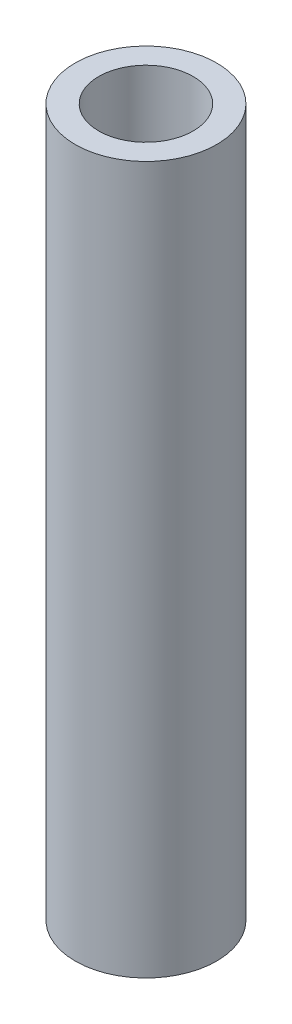
ISO-10303-21;
HEADER;
FILE_DESCRIPTION(('STEP AP214'),'2;1');
FILE_NAME('part.step','',(''),(''),'','','');
FILE_SCHEMA(('AUTOMOTIVE_DESIGN { 1 0 10303 214 1 1 1 1 }'));
ENDSEC;
DATA;
#1=APPLICATION_CONTEXT('core data for automotive mechanical design processes');
#2=APPLICATION_PROTOCOL_DEFINITION('international standard','automotive_design',2000,#1);
#3=PRODUCT_CONTEXT('',#1,'mechanical');
#4=PRODUCT('Part','Part','',(#3));
#5=PRODUCT_RELATED_PRODUCT_CATEGORY('part','',(#4));
#6=PRODUCT_DEFINITION_FORMATION('','',#4);
#7=PRODUCT_DEFINITION_CONTEXT('part definition',#1,'design');
#8=PRODUCT_DEFINITION('design','',#6,#7);
#9=PRODUCT_DEFINITION_SHAPE('','',#8);
#10=(LENGTH_UNIT() NAMED_UNIT(*) SI_UNIT(.MILLI.,.METRE.));
#11=(NAMED_UNIT(*) PLANE_ANGLE_UNIT() SI_UNIT($,.RADIAN.));
#12=(NAMED_UNIT(*) SI_UNIT($,.STERADIAN.) SOLID_ANGLE_UNIT());
#13=UNCERTAINTY_MEASURE_WITH_UNIT(LENGTH_MEASURE(1.E-05),#10,'distance_accuracy_value','');
#14=(GEOMETRIC_REPRESENTATION_CONTEXT(3) GLOBAL_UNCERTAINTY_ASSIGNED_CONTEXT((#13)) GLOBAL_UNIT_ASSIGNED_CONTEXT((#10,
#11,#12)) REPRESENTATION_CONTEXT('',''));
#15=CARTESIAN_POINT('',(0.,0.,0.));
#16=DIRECTION('',(0.,0.,1.));
#17=DIRECTION('',(1.,0.,0.));
#18=AXIS2_PLACEMENT_3D('',#15,#16,#17);
#19=CARTESIAN_POINT('',(0.,125.,0.));
#20=DIRECTION('',(0.,1.,0.));
#21=DIRECTION('',(0.,0.,1.));
#22=AXIS2_PLACEMENT_3D('',#19,#20,#21);
#23=PLANE('',#22);
#24=CARTESIAN_POINT('',(0.,125.,0.));
#25=DIRECTION('',(0.,1.,0.));
#26=DIRECTION('',(0.,0.,1.));
#27=AXIS2_PLACEMENT_3D('',#24,#25,#26);
#28=CIRCLE('',#27,25.);
#29=CARTESIAN_POINT('',(0.,125.,25.));
#30=VERTEX_POINT('',#29);
#31=EDGE_CURVE('E10',#30,#30,#28,.T.);
#32=ORIENTED_EDGE('',*,*,#31,.T.);
#33=EDGE_LOOP('',(#32));
#34=FACE_BOUND('',#33,.T.);
#35=CARTESIAN_POINT('',(0.,125.,0.));
#36=DIRECTION('',(0.,1.,0.));
#37=DIRECTION('',(0.,0.,1.));
#38=AXIS2_PLACEMENT_3D('',#35,#36,#37);
#39=CIRCLE('',#38,16.7);
#40=CARTESIAN_POINT('',(0.,125.,16.7));
#41=VERTEX_POINT('',#40);
#42=EDGE_CURVE('E41',#41,#41,#39,.T.);
#43=ORIENTED_EDGE('',*,*,#42,.F.);
#44=EDGE_LOOP('',(#43));
#45=FACE_BOUND('',#44,.T.);
#46=ADVANCED_FACE('F30',(#34,#45),#23,.T.);
#47=CARTESIAN_POINT('',(0.,-125.,0.));
#48=DIRECTION('',(0.,1.,0.));
#49=DIRECTION('',(0.,0.,1.));
#50=AXIS2_PLACEMENT_3D('',#47,#48,#49);
#51=PLANE('',#50);
#52=CARTESIAN_POINT('',(0.,-125.,0.));
#53=DIRECTION('',(0.,1.,0.));
#54=DIRECTION('',(0.,0.,1.));
#55=AXIS2_PLACEMENT_3D('',#52,#53,#54);
#56=CIRCLE('',#55,25.);
#57=CARTESIAN_POINT('',(0.,-125.,25.));
#58=VERTEX_POINT('',#57);
#59=EDGE_CURVE('E34',#58,#58,#56,.T.);
#60=ORIENTED_EDGE('',*,*,#59,.F.);
#61=EDGE_LOOP('',(#60));
#62=FACE_BOUND('',#61,.T.);
#63=CARTESIAN_POINT('',(0.,-125.,0.));
#64=DIRECTION('',(0.,1.,0.));
#65=DIRECTION('',(0.,0.,1.));
#66=AXIS2_PLACEMENT_3D('',#63,#64,#65);
#67=CIRCLE('',#66,16.7);
#68=CARTESIAN_POINT('',(0.,-125.,16.7));
#69=VERTEX_POINT('',#68);
#70=EDGE_CURVE('E43',#69,#69,#67,.T.);
#71=ORIENTED_EDGE('',*,*,#70,.T.);
#72=EDGE_LOOP('',(#71));
#73=FACE_BOUND('',#72,.T.);
#74=ADVANCED_FACE('F53',(#62,#73),#51,.F.);
#75=CARTESIAN_POINT('',(0.,125.,0.));
#76=DIRECTION('',(0.,-1.,0.));
#77=DIRECTION('',(0.,0.,-1.));
#78=AXIS2_PLACEMENT_3D('',#75,#76,#77);
#79=CYLINDRICAL_SURFACE('',#78,25.);
#80=ORIENTED_EDGE('',*,*,#31,.F.);
#81=EDGE_LOOP('',(#80));
#82=FACE_BOUND('',#81,.T.);
#83=ORIENTED_EDGE('',*,*,#59,.T.);
#84=EDGE_LOOP('',(#83));
#85=FACE_BOUND('',#84,.T.);
#86=ADVANCED_FACE('F32',(#82,#85),#79,.T.);
#87=CARTESIAN_POINT('',(0.,125.,0.));
#88=DIRECTION('',(0.,-1.,0.));
#89=DIRECTION('',(0.,0.,-1.));
#90=AXIS2_PLACEMENT_3D('',#87,#88,#89);
#91=CYLINDRICAL_SURFACE('',#90,16.7);
#92=ORIENTED_EDGE('',*,*,#42,.T.);
#93=EDGE_LOOP('',(#92));
#94=FACE_BOUND('',#93,.T.);
#95=ORIENTED_EDGE('',*,*,#70,.F.);
#96=EDGE_LOOP('',(#95));
#97=FACE_BOUND('',#96,.T.);
#98=ADVANCED_FACE('F49',(#94,#97),#91,.F.);
#99=CLOSED_SHELL('',(#46,#74,#86,#98));
#100=MANIFOLD_SOLID_BREP('B2',#99);
#101=ADVANCED_BREP_SHAPE_REPRESENTATION('',(#18,#100),#14);
#102=SHAPE_DEFINITION_REPRESENTATION(#9,#101);
ENDSEC;
END-ISO-10303-21;
